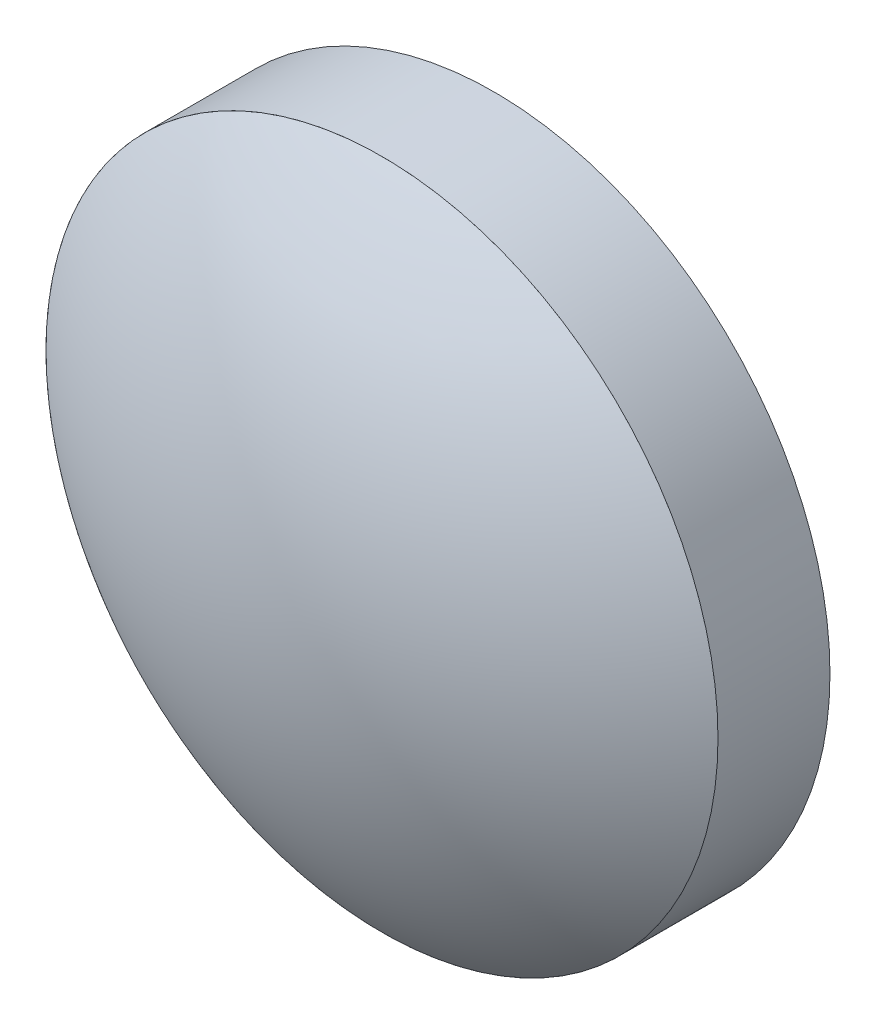
ISO-10303-21;
HEADER;
FILE_DESCRIPTION(('STEP AP214'),'2;1');
FILE_NAME('part.step','',(''),(''),'','','');
FILE_SCHEMA(('AUTOMOTIVE_DESIGN { 1 0 10303 214 1 1 1 1 }'));
ENDSEC;
DATA;
#1=APPLICATION_CONTEXT('core data for automotive mechanical design processes');
#2=APPLICATION_PROTOCOL_DEFINITION('international standard','automotive_design',2000,#1);
#3=PRODUCT_CONTEXT('',#1,'mechanical');
#4=PRODUCT('Part','Part','',(#3));
#5=PRODUCT_RELATED_PRODUCT_CATEGORY('part','',(#4));
#6=PRODUCT_DEFINITION_FORMATION('','',#4);
#7=PRODUCT_DEFINITION_CONTEXT('part definition',#1,'design');
#8=PRODUCT_DEFINITION('design','',#6,#7);
#9=PRODUCT_DEFINITION_SHAPE('','',#8);
#10=(LENGTH_UNIT() NAMED_UNIT(*) SI_UNIT(.MILLI.,.METRE.));
#11=(NAMED_UNIT(*) PLANE_ANGLE_UNIT() SI_UNIT($,.RADIAN.));
#12=(NAMED_UNIT(*) SI_UNIT($,.STERADIAN.) SOLID_ANGLE_UNIT());
#13=UNCERTAINTY_MEASURE_WITH_UNIT(LENGTH_MEASURE(1.E-05),#10,'distance_accuracy_value','');
#14=(GEOMETRIC_REPRESENTATION_CONTEXT(3) GLOBAL_UNCERTAINTY_ASSIGNED_CONTEXT((#13)) GLOBAL_UNIT_ASSIGNED_CONTEXT((#10,
#11,#12)) REPRESENTATION_CONTEXT('',''));
#15=CARTESIAN_POINT('',(0.,0.,0.));
#16=DIRECTION('',(0.,0.,1.));
#17=DIRECTION('',(1.,0.,0.));
#18=AXIS2_PLACEMENT_3D('',#15,#16,#17);
#19=CARTESIAN_POINT('',(0.,0.,2.));
#20=DIRECTION('',(0.,0.,1.));
#21=DIRECTION('',(-1.,0.,0.));
#22=AXIS2_PLACEMENT_3D('',#19,#20,#21);
#23=SPHERICAL_SURFACE('',#22,1.6);
#24=CARTESIAN_POINT('',(0.,0.,2.));
#25=DIRECTION('',(0.,0.,1.));
#26=DIRECTION('',(1.,0.,0.));
#27=AXIS2_PLACEMENT_3D('',#24,#25,#26);
#28=CIRCLE('',#27,1.6);
#29=CARTESIAN_POINT('',(1.6,0.,2.));
#30=VERTEX_POINT('',#29);
#31=EDGE_CURVE('E49',#30,#30,#28,.T.);
#32=ORIENTED_EDGE('',*,*,#31,.T.);
#33=EDGE_LOOP('',(#32));
#34=FACE_BOUND('',#33,.T.);
#35=ADVANCED_FACE('F43',(#34),#23,.T.);
#36=CARTESIAN_POINT('',(0.,0.,2.));
#37=DIRECTION('',(0.,0.,1.));
#38=DIRECTION('',(1.,0.,0.));
#39=AXIS2_PLACEMENT_3D('',#36,#37,#38);
#40=SPHERICAL_SURFACE('',#39,1.3);
#41=CARTESIAN_POINT('',(0.,0.,2.));
#42=DIRECTION('',(0.,0.,1.));
#43=DIRECTION('',(1.,0.,0.));
#44=AXIS2_PLACEMENT_3D('',#41,#42,#43);
#45=CIRCLE('',#44,1.3);
#46=CARTESIAN_POINT('',(1.3,0.,2.));
#47=VERTEX_POINT('',#46);
#48=EDGE_CURVE('E11',#47,#47,#45,.T.);
#49=ORIENTED_EDGE('',*,*,#48,.F.);
#50=EDGE_LOOP('',(#49));
#51=FACE_BOUND('',#50,.T.);
#52=ADVANCED_FACE('F58',(#51),#40,.F.);
#53=CARTESIAN_POINT('',(-1.6,0.,2.));
#54=DIRECTION('',(0.,0.,1.));
#55=DIRECTION('',(1.,0.,0.));
#56=AXIS2_PLACEMENT_3D('',#53,#54,#55);
#57=PLANE('',#56);
#58=ORIENTED_EDGE('',*,*,#31,.F.);
#59=EDGE_LOOP('',(#58));
#60=FACE_BOUND('',#59,.T.);
#61=ORIENTED_EDGE('',*,*,#48,.T.);
#62=EDGE_LOOP('',(#61));
#63=FACE_BOUND('',#62,.T.);
#64=ADVANCED_FACE('F56',(#60,#63),#57,.F.);
#65=CLOSED_SHELL('',(#35,#52,#64));
#66=MANIFOLD_SOLID_BREP('B2',#65);
#67=CARTESIAN_POINT('',(0.,0.,-6.));
#68=DIRECTION('',(0.,0.,1.));
#69=DIRECTION('',(-1.,0.,0.));
#70=AXIS2_PLACEMENT_3D('',#67,#68,#69);
#71=SPHERICAL_SURFACE('',#70,10.);
#72=CARTESIAN_POINT('',(0.,0.,2.));
#73=DIRECTION('',(0.,0.,1.));
#74=DIRECTION('',(1.,0.,0.));
#75=AXIS2_PLACEMENT_3D('',#72,#73,#74);
#76=CIRCLE('',#75,6.);
#77=CARTESIAN_POINT('',(6.,0.,2.));
#78=VERTEX_POINT('',#77);
#79=EDGE_CURVE('E96',#78,#78,#76,.T.);
#80=ORIENTED_EDGE('',*,*,#79,.T.);
#81=EDGE_LOOP('',(#80));
#82=FACE_BOUND('',#81,.T.);
#83=ADVANCED_FACE('F90',(#82),#71,.T.);
#84=CARTESIAN_POINT('',(0.,0.,-6.));
#85=DIRECTION('',(0.,0.,1.));
#86=DIRECTION('',(1.,0.,0.));
#87=AXIS2_PLACEMENT_3D('',#84,#85,#86);
#88=SPHERICAL_SURFACE('',#87,9.7);
#89=CARTESIAN_POINT('',(0.,0.,2.));
#90=DIRECTION('',(0.,0.,1.));
#91=DIRECTION('',(1.,0.,0.));
#92=AXIS2_PLACEMENT_3D('',#89,#90,#91);
#93=CIRCLE('',#92,5.48543526076099);
#94=CARTESIAN_POINT('',(5.48543526076099,0.,2.));
#95=VERTEX_POINT('',#94);
#96=EDGE_CURVE('E42',#95,#95,#93,.T.);
#97=ORIENTED_EDGE('',*,*,#96,.F.);
#98=EDGE_LOOP('',(#97));
#99=FACE_BOUND('',#98,.T.);
#100=ADVANCED_FACE('F105',(#99),#88,.F.);
#101=CARTESIAN_POINT('',(-6.,0.,2.));
#102=DIRECTION('',(0.,0.,1.));
#103=DIRECTION('',(1.,0.,0.));
#104=AXIS2_PLACEMENT_3D('',#101,#102,#103);
#105=PLANE('',#104);
#106=ORIENTED_EDGE('',*,*,#79,.F.);
#107=EDGE_LOOP('',(#106));
#108=FACE_BOUND('',#107,.T.);
#109=ORIENTED_EDGE('',*,*,#96,.T.);
#110=EDGE_LOOP('',(#109));
#111=FACE_BOUND('',#110,.T.);
#112=ADVANCED_FACE('F103',(#108,#111),#105,.F.);
#113=CLOSED_SHELL('',(#83,#100,#112));
#114=MANIFOLD_SOLID_BREP('B6',#113);
#115=CARTESIAN_POINT('',(0.,0.,2.));
#116=DIRECTION('',(0.,0.,-1.));
#117=DIRECTION('',(-1.,0.,0.));
#118=AXIS2_PLACEMENT_3D('',#115,#116,#117);
#119=CYLINDRICAL_SURFACE('',#118,6.);
#120=CARTESIAN_POINT('',(0.,0.,2.));
#121=DIRECTION('',(0.,0.,1.));
#122=DIRECTION('',(1.,0.,0.));
#123=AXIS2_PLACEMENT_3D('',#120,#121,#122);
#124=CIRCLE('',#123,6.);
#125=CARTESIAN_POINT('',(6.,0.,2.));
#126=VERTEX_POINT('',#125);
#127=EDGE_CURVE('E89',#126,#126,#124,.T.);
#128=ORIENTED_EDGE('',*,*,#127,.F.);
#129=EDGE_LOOP('',(#128));
#130=FACE_BOUND('',#129,.T.);
#131=CARTESIAN_POINT('',(0.,0.,0.));
#132=DIRECTION('',(0.,0.,1.));
#133=DIRECTION('',(1.,0.,0.));
#134=AXIS2_PLACEMENT_3D('',#131,#132,#133);
#135=CIRCLE('',#134,6.);
#136=CARTESIAN_POINT('',(6.,0.,0.));
#137=VERTEX_POINT('',#136);
#138=EDGE_CURVE('E133',#137,#137,#135,.T.);
#139=ORIENTED_EDGE('',*,*,#138,.T.);
#140=EDGE_LOOP('',(#139));
#141=FACE_BOUND('',#140,.T.);
#142=ADVANCED_FACE('F130',(#130,#141),#119,.T.);
#143=CARTESIAN_POINT('',(0.,0.,2.));
#144=DIRECTION('',(0.,0.,1.));
#145=DIRECTION('',(1.,0.,0.));
#146=AXIS2_PLACEMENT_3D('',#143,#144,#145);
#147=PLANE('',#146);
#148=CARTESIAN_POINT('',(0.,0.,2.));
#149=DIRECTION('',(0.,0.,1.));
#150=DIRECTION('',(1.,0.,0.));
#151=AXIS2_PLACEMENT_3D('',#148,#149,#150);
#152=CIRCLE('',#151,0.75);
#153=CARTESIAN_POINT('',(0.75,0.,2.));
#154=VERTEX_POINT('',#153);
#155=EDGE_CURVE('E142',#154,#154,#152,.T.);
#156=ORIENTED_EDGE('',*,*,#155,.F.);
#157=EDGE_LOOP('',(#156));
#158=FACE_BOUND('',#157,.T.);
#159=ORIENTED_EDGE('',*,*,#127,.T.);
#160=EDGE_LOOP('',(#159));
#161=FACE_BOUND('',#160,.T.);
#162=ADVANCED_FACE('F157',(#158,#161),#147,.T.);
#163=CARTESIAN_POINT('',(0.,0.,0.));
#164=DIRECTION('',(0.,0.,1.));
#165=DIRECTION('',(1.,0.,0.));
#166=AXIS2_PLACEMENT_3D('',#163,#164,#165);
#167=PLANE('',#166);
#168=ORIENTED_EDGE('',*,*,#138,.F.);
#169=EDGE_LOOP('',(#168));
#170=FACE_BOUND('',#169,.T.);
#171=ADVANCED_FACE('F153',(#170),#167,.F.);
#172=CARTESIAN_POINT('',(0.,0.,1.8));
#173=DIRECTION('',(0.,0.,1.));
#174=DIRECTION('',(1.,0.,0.));
#175=AXIS2_PLACEMENT_3D('',#172,#173,#174);
#176=CYLINDRICAL_SURFACE('',#175,0.75);
#177=CARTESIAN_POINT('',(0.,0.,1.8));
#178=DIRECTION('',(0.,0.,1.));
#179=DIRECTION('',(1.,0.,0.));
#180=AXIS2_PLACEMENT_3D('',#177,#178,#179);
#181=CIRCLE('',#180,0.75);
#182=CARTESIAN_POINT('',(0.75,0.,1.8));
#183=VERTEX_POINT('',#182);
#184=EDGE_CURVE('E140',#183,#183,#181,.T.);
#185=ORIENTED_EDGE('',*,*,#184,.F.);
#186=EDGE_LOOP('',(#185));
#187=FACE_BOUND('',#186,.T.);
#188=ORIENTED_EDGE('',*,*,#155,.T.);
#189=EDGE_LOOP('',(#188));
#190=FACE_BOUND('',#189,.T.);
#191=ADVANCED_FACE('F150',(#187,#190),#176,.F.);
#192=CARTESIAN_POINT('',(0.,0.,1.8));
#193=DIRECTION('',(0.,0.,1.));
#194=DIRECTION('',(1.,0.,0.));
#195=AXIS2_PLACEMENT_3D('',#192,#193,#194);
#196=PLANE('',#195);
#197=ORIENTED_EDGE('',*,*,#184,.T.);
#198=EDGE_LOOP('',(#197));
#199=FACE_BOUND('',#198,.T.);
#200=ADVANCED_FACE('F148',(#199),#196,.T.);
#201=CLOSED_SHELL('',(#142,#162,#171,#191,#200));
#202=MANIFOLD_SOLID_BREP('B37',#201);
#203=ADVANCED_BREP_SHAPE_REPRESENTATION('',(#18,#66,#114,#202),#14);
#204=SHAPE_DEFINITION_REPRESENTATION(#9,#203);
ENDSEC;
END-ISO-10303-21;
